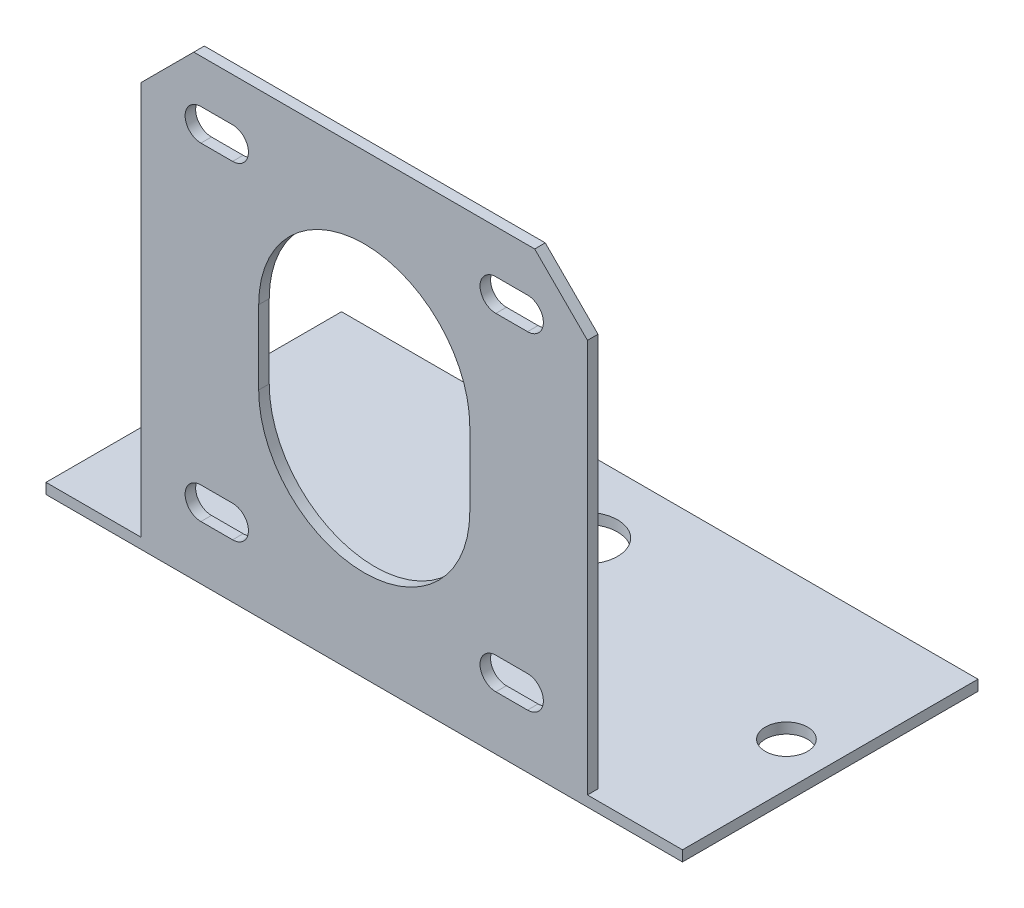
ISO-10303-21;
HEADER;
FILE_DESCRIPTION(('STEP AP214'),'2;1');
FILE_NAME('part.step','',(''),(''),'','','');
FILE_SCHEMA(('AUTOMOTIVE_DESIGN { 1 0 10303 214 1 1 1 1 }'));
ENDSEC;
DATA;
#1=APPLICATION_CONTEXT('core data for automotive mechanical design processes');
#2=APPLICATION_PROTOCOL_DEFINITION('international standard','automotive_design',2000,#1);
#3=PRODUCT_CONTEXT('',#1,'mechanical');
#4=PRODUCT('Part','Part','',(#3));
#5=PRODUCT_RELATED_PRODUCT_CATEGORY('part','',(#4));
#6=PRODUCT_DEFINITION_FORMATION('','',#4);
#7=PRODUCT_DEFINITION_CONTEXT('part definition',#1,'design');
#8=PRODUCT_DEFINITION('design','',#6,#7);
#9=PRODUCT_DEFINITION_SHAPE('','',#8);
#10=(LENGTH_UNIT() NAMED_UNIT(*) SI_UNIT(.MILLI.,.METRE.));
#11=(NAMED_UNIT(*) PLANE_ANGLE_UNIT() SI_UNIT($,.RADIAN.));
#12=(NAMED_UNIT(*) SI_UNIT($,.STERADIAN.) SOLID_ANGLE_UNIT());
#13=UNCERTAINTY_MEASURE_WITH_UNIT(LENGTH_MEASURE(1.E-05),#10,'distance_accuracy_value','');
#14=(GEOMETRIC_REPRESENTATION_CONTEXT(3) GLOBAL_UNCERTAINTY_ASSIGNED_CONTEXT((#13)) GLOBAL_UNIT_ASSIGNED_CONTEXT((#10,
#11,#12)) REPRESENTATION_CONTEXT('',''));
#15=CARTESIAN_POINT('',(0.,0.,0.));
#16=DIRECTION('',(0.,0.,1.));
#17=DIRECTION('',(1.,0.,0.));
#18=AXIS2_PLACEMENT_3D('',#15,#16,#17);
#19=CARTESIAN_POINT('',(21.15,-21.15,1.));
#20=DIRECTION('',(-1.,0.,0.));
#21=DIRECTION('',(0.,0.,1.));
#22=AXIS2_PLACEMENT_3D('',#19,#20,#21);
#23=PLANE('',#22);
#24=DIRECTION('',(0.,0.,1.));
#25=VECTOR('',#24,1.);
#26=CARTESIAN_POINT('',(21.15,-21.15,0.));
#27=LINE('',#26,#25);
#28=CARTESIAN_POINT('',(21.15,-21.15,0.));
#29=VERTEX_POINT('',#28);
#30=CARTESIAN_POINT('',(21.15,-21.15,1.));
#31=VERTEX_POINT('',#30);
#32=EDGE_CURVE('E46',#29,#31,#27,.T.);
#33=ORIENTED_EDGE('',*,*,#32,.F.);
#34=DIRECTION('',(0.,1.,0.));
#35=VECTOR('',#34,1.);
#36=CARTESIAN_POINT('',(21.15,-21.15,0.));
#37=LINE('',#36,#35);
#38=CARTESIAN_POINT('',(21.15,16.15,0.));
#39=VERTEX_POINT('',#38);
#40=EDGE_CURVE('E446',#29,#39,#37,.T.);
#41=ORIENTED_EDGE('',*,*,#40,.T.);
#42=DIRECTION('',(0.,0.,1.));
#43=VECTOR('',#42,1.);
#44=CARTESIAN_POINT('',(21.15,16.15,1.));
#45=LINE('',#44,#43);
#46=CARTESIAN_POINT('',(21.15,16.15,1.));
#47=VERTEX_POINT('',#46);
#48=EDGE_CURVE('E471',#39,#47,#45,.T.);
#49=ORIENTED_EDGE('',*,*,#48,.T.);
#50=DIRECTION('',(0.,1.,0.));
#51=VECTOR('',#50,1.);
#52=CARTESIAN_POINT('',(21.15,-21.15,1.));
#53=LINE('',#52,#51);
#54=EDGE_CURVE('E435',#31,#47,#53,.T.);
#55=ORIENTED_EDGE('',*,*,#54,.F.);
#56=EDGE_LOOP('',(#33,#41,#49,#55));
#57=FACE_BOUND('',#56,.T.);
#58=ADVANCED_FACE('F36',(#57),#23,.F.);
#59=CARTESIAN_POINT('',(0.,0.,1.));
#60=DIRECTION('',(0.,0.,1.));
#61=DIRECTION('',(1.,0.,0.));
#62=AXIS2_PLACEMENT_3D('',#59,#60,#61);
#63=PLANE('',#62);
#64=CARTESIAN_POINT('',(15.4709315688123,15.525299873685,1.));
#65=DIRECTION('',(0.,0.,1.));
#66=DIRECTION('',(-1.,0.,0.));
#67=AXIS2_PLACEMENT_3D('',#64,#65,#66);
#68=CIRCLE('',#67,1.5);
#69=CARTESIAN_POINT('',(15.4709315688123,14.025299873685,1.));
#70=VERTEX_POINT('',#69);
#71=CARTESIAN_POINT('',(15.4709315688123,17.025299873685,1.));
#72=VERTEX_POINT('',#71);
#73=EDGE_CURVE('E292',#70,#72,#68,.T.);
#74=ORIENTED_EDGE('',*,*,#73,.F.);
#75=DIRECTION('',(1.,0.,0.));
#76=VECTOR('',#75,1.);
#77=CARTESIAN_POINT('',(15.4709315688123,14.025299873685,1.));
#78=LINE('',#77,#76);
#79=CARTESIAN_POINT('',(12.4709315688123,14.025299873685,1.));
#80=VERTEX_POINT('',#79);
#81=EDGE_CURVE('E300',#80,#70,#78,.T.);
#82=ORIENTED_EDGE('',*,*,#81,.F.);
#83=CARTESIAN_POINT('',(12.4709315688123,15.525299873685,1.));
#84=DIRECTION('',(0.,0.,1.));
#85=DIRECTION('',(-1.,0.,0.));
#86=AXIS2_PLACEMENT_3D('',#83,#84,#85);
#87=CIRCLE('',#86,1.5);
#88=CARTESIAN_POINT('',(12.4709315688123,17.025299873685,1.));
#89=VERTEX_POINT('',#88);
#90=EDGE_CURVE('E297',#89,#80,#87,.T.);
#91=ORIENTED_EDGE('',*,*,#90,.F.);
#92=DIRECTION('',(-1.,0.,0.));
#93=VECTOR('',#92,1.);
#94=CARTESIAN_POINT('',(15.4709315688123,17.025299873685,1.));
#95=LINE('',#94,#93);
#96=EDGE_CURVE('E294',#72,#89,#95,.T.);
#97=ORIENTED_EDGE('',*,*,#96,.F.);
#98=EDGE_LOOP('',(#74,#82,#91,#97));
#99=FACE_BOUND('',#98,.T.);
#100=CARTESIAN_POINT('',(0.,3.5,1.));
#101=DIRECTION('',(0.,0.,1.));
#102=DIRECTION('',(1.,0.,0.));
#103=AXIS2_PLACEMENT_3D('',#100,#101,#102);
#104=CIRCLE('',#103,10.);
#105=CARTESIAN_POINT('',(10.,3.5,1.));
#106=VERTEX_POINT('',#105);
#107=CARTESIAN_POINT('',(-10.,3.5,1.));
#108=VERTEX_POINT('',#107);
#109=EDGE_CURVE('E348',#106,#108,#104,.T.);
#110=ORIENTED_EDGE('',*,*,#109,.F.);
#111=DIRECTION('',(0.,1.,0.));
#112=VECTOR('',#111,1.);
#113=CARTESIAN_POINT('',(10.,3.5,1.));
#114=LINE('',#113,#112);
#115=CARTESIAN_POINT('',(10.,-3.5,1.));
#116=VERTEX_POINT('',#115);
#117=EDGE_CURVE('E356',#116,#106,#114,.T.);
#118=ORIENTED_EDGE('',*,*,#117,.F.);
#119=CARTESIAN_POINT('',(0.,-3.5,1.));
#120=DIRECTION('',(0.,0.,1.));
#121=DIRECTION('',(1.,0.,0.));
#122=AXIS2_PLACEMENT_3D('',#119,#120,#121);
#123=CIRCLE('',#122,10.);
#124=CARTESIAN_POINT('',(-10.,-3.5,1.));
#125=VERTEX_POINT('',#124);
#126=EDGE_CURVE('E353',#125,#116,#123,.T.);
#127=ORIENTED_EDGE('',*,*,#126,.F.);
#128=DIRECTION('',(0.,-1.,0.));
#129=VECTOR('',#128,1.);
#130=CARTESIAN_POINT('',(-10.,3.5,1.));
#131=LINE('',#130,#129);
#132=EDGE_CURVE('E350',#108,#125,#131,.T.);
#133=ORIENTED_EDGE('',*,*,#132,.F.);
#134=EDGE_LOOP('',(#110,#118,#127,#133));
#135=FACE_BOUND('',#134,.T.);
#136=CARTESIAN_POINT('',(-15.4709315688123,-15.525299873685,1.));
#137=DIRECTION('',(0.,0.,1.));
#138=DIRECTION('',(1.,0.,0.));
#139=AXIS2_PLACEMENT_3D('',#136,#137,#138);
#140=CIRCLE('',#139,1.5);
#141=CARTESIAN_POINT('',(-15.4709315688123,-14.025299873685,1.));
#142=VERTEX_POINT('',#141);
#143=CARTESIAN_POINT('',(-15.4709315688123,-17.025299873685,1.));
#144=VERTEX_POINT('',#143);
#145=EDGE_CURVE('E409',#142,#144,#140,.T.);
#146=ORIENTED_EDGE('',*,*,#145,.F.);
#147=DIRECTION('',(-1.,0.,0.));
#148=VECTOR('',#147,1.);
#149=CARTESIAN_POINT('',(-15.4709315688123,-14.025299873685,1.));
#150=LINE('',#149,#148);
#151=CARTESIAN_POINT('',(-12.4709315688123,-14.025299873685,1.));
#152=VERTEX_POINT('',#151);
#153=EDGE_CURVE('E417',#152,#142,#150,.T.);
#154=ORIENTED_EDGE('',*,*,#153,.F.);
#155=CARTESIAN_POINT('',(-12.4709315688123,-15.525299873685,1.));
#156=DIRECTION('',(0.,0.,1.));
#157=DIRECTION('',(1.,0.,0.));
#158=AXIS2_PLACEMENT_3D('',#155,#156,#157);
#159=CIRCLE('',#158,1.5);
#160=CARTESIAN_POINT('',(-12.4709315688123,-17.025299873685,1.));
#161=VERTEX_POINT('',#160);
#162=EDGE_CURVE('E414',#161,#152,#159,.T.);
#163=ORIENTED_EDGE('',*,*,#162,.F.);
#164=DIRECTION('',(1.,0.,0.));
#165=VECTOR('',#164,1.);
#166=CARTESIAN_POINT('',(-15.4709315688123,-17.025299873685,1.));
#167=LINE('',#166,#165);
#168=EDGE_CURVE('E411',#144,#161,#167,.T.);
#169=ORIENTED_EDGE('',*,*,#168,.F.);
#170=EDGE_LOOP('',(#146,#154,#163,#169));
#171=FACE_BOUND('',#170,.T.);
#172=DIRECTION('',(-1.,0.,0.));
#173=VECTOR('',#172,1.);
#174=CARTESIAN_POINT('',(-21.15,-22.15,1.));
#175=LINE('',#174,#173);
#176=CARTESIAN_POINT('',(30.15,-22.15,1.));
#177=VERTEX_POINT('',#176);
#178=CARTESIAN_POINT('',(-30.15,-22.15,1.));
#179=VERTEX_POINT('',#178);
#180=EDGE_CURVE('E245',#177,#179,#175,.T.);
#181=ORIENTED_EDGE('',*,*,#180,.F.);
#182=DIRECTION('',(0.,-1.,0.));
#183=VECTOR('',#182,1.);
#184=CARTESIAN_POINT('',(30.15,-21.15,1.));
#185=LINE('',#184,#183);
#186=CARTESIAN_POINT('',(30.15,-21.15,1.));
#187=VERTEX_POINT('',#186);
#188=EDGE_CURVE('E268',#187,#177,#185,.T.);
#189=ORIENTED_EDGE('',*,*,#188,.F.);
#190=DIRECTION('',(-1.,0.,0.));
#191=VECTOR('',#190,1.);
#192=CARTESIAN_POINT('',(30.15,-21.15,1.));
#193=LINE('',#192,#191);
#194=EDGE_CURVE('E276',#187,#31,#193,.T.);
#195=ORIENTED_EDGE('',*,*,#194,.T.);
#196=ORIENTED_EDGE('',*,*,#54,.T.);
#197=DIRECTION('',(0.707106781186547,-0.707106781186549,0.));
#198=VECTOR('',#197,1.);
#199=CARTESIAN_POINT('',(18.65,18.65,1.));
#200=LINE('',#199,#198);
#201=CARTESIAN_POINT('',(16.15,21.15,1.));
#202=VERTEX_POINT('',#201);
#203=EDGE_CURVE('E475',#47,#202,#200,.F.);
#204=ORIENTED_EDGE('',*,*,#203,.T.);
#205=DIRECTION('',(-1.,0.,0.));
#206=VECTOR('',#205,1.);
#207=CARTESIAN_POINT('',(21.15,21.15,1.));
#208=LINE('',#207,#206);
#209=CARTESIAN_POINT('',(-16.15,21.15,1.));
#210=VERTEX_POINT('',#209);
#211=EDGE_CURVE('E438',#202,#210,#208,.T.);
#212=ORIENTED_EDGE('',*,*,#211,.T.);
#213=DIRECTION('',(0.707106781186549,0.707106781186546,0.));
#214=VECTOR('',#213,1.);
#215=CARTESIAN_POINT('',(-18.65,18.65,1.));
#216=LINE('',#215,#214);
#217=CARTESIAN_POINT('',(-21.15,16.15,1.));
#218=VERTEX_POINT('',#217);
#219=EDGE_CURVE('E61',#210,#218,#216,.F.);
#220=ORIENTED_EDGE('',*,*,#219,.T.);
#221=DIRECTION('',(0.,-1.,0.));
#222=VECTOR('',#221,1.);
#223=CARTESIAN_POINT('',(-21.15,-21.15,1.));
#224=LINE('',#223,#222);
#225=CARTESIAN_POINT('',(-21.15,-21.15,1.));
#226=VERTEX_POINT('',#225);
#227=EDGE_CURVE('E433',#218,#226,#224,.T.);
#228=ORIENTED_EDGE('',*,*,#227,.T.);
#229=DIRECTION('',(1.,0.,0.));
#230=VECTOR('',#229,1.);
#231=CARTESIAN_POINT('',(-30.15,-21.15,1.));
#232=LINE('',#231,#230);
#233=CARTESIAN_POINT('',(-30.15,-21.15,1.));
#234=VERTEX_POINT('',#233);
#235=EDGE_CURVE('E54',#234,#226,#232,.T.);
#236=ORIENTED_EDGE('',*,*,#235,.F.);
#237=DIRECTION('',(0.,-1.,0.));
#238=VECTOR('',#237,1.);
#239=CARTESIAN_POINT('',(-30.15,-21.15,1.));
#240=LINE('',#239,#238);
#241=EDGE_CURVE('E256',#234,#179,#240,.T.);
#242=ORIENTED_EDGE('',*,*,#241,.T.);
#243=EDGE_LOOP('',(#181,#189,#195,#196,#204,#212,#220,#228,#236,#242));
#244=FACE_BOUND('',#243,.T.);
#245=DIRECTION('',(1.,0.,0.));
#246=VECTOR('',#245,1.);
#247=CARTESIAN_POINT('',(15.4709315688123,-14.025299873685,1.));
#248=LINE('',#247,#246);
#249=CARTESIAN_POINT('',(12.4709315688123,-14.025299873685,1.));
#250=VERTEX_POINT('',#249);
#251=CARTESIAN_POINT('',(15.4709315688123,-14.025299873685,1.));
#252=VERTEX_POINT('',#251);
#253=EDGE_CURVE('E380',#250,#252,#248,.T.);
#254=ORIENTED_EDGE('',*,*,#253,.T.);
#255=CARTESIAN_POINT('',(15.4709315688123,-15.525299873685,1.));
#256=DIRECTION('',(0.,0.,-1.));
#257=DIRECTION('',(-1.,0.,0.));
#258=AXIS2_PLACEMENT_3D('',#255,#256,#257);
#259=CIRCLE('',#258,1.5);
#260=CARTESIAN_POINT('',(15.4709315688123,-17.025299873685,1.));
#261=VERTEX_POINT('',#260);
#262=EDGE_CURVE('E377',#252,#261,#259,.T.);
#263=ORIENTED_EDGE('',*,*,#262,.T.);
#264=DIRECTION('',(-1.,0.,0.));
#265=VECTOR('',#264,1.);
#266=CARTESIAN_POINT('',(15.4709315688123,-17.025299873685,1.));
#267=LINE('',#266,#265);
#268=CARTESIAN_POINT('',(12.4709315688123,-17.025299873685,1.));
#269=VERTEX_POINT('',#268);
#270=EDGE_CURVE('E386',#261,#269,#267,.T.);
#271=ORIENTED_EDGE('',*,*,#270,.T.);
#272=CARTESIAN_POINT('',(12.4709315688123,-15.525299873685,1.));
#273=DIRECTION('',(0.,0.,-1.));
#274=DIRECTION('',(-1.,0.,0.));
#275=AXIS2_PLACEMENT_3D('',#272,#273,#274);
#276=CIRCLE('',#275,1.5);
#277=EDGE_CURVE('E383',#269,#250,#276,.T.);
#278=ORIENTED_EDGE('',*,*,#277,.T.);
#279=EDGE_LOOP('',(#254,#263,#271,#278));
#280=FACE_BOUND('',#279,.T.);
#281=DIRECTION('',(-1.,0.,0.));
#282=VECTOR('',#281,1.);
#283=CARTESIAN_POINT('',(-15.4709315688123,14.025299873685,1.));
#284=LINE('',#283,#282);
#285=CARTESIAN_POINT('',(-12.4709315688123,14.025299873685,1.));
#286=VERTEX_POINT('',#285);
#287=CARTESIAN_POINT('',(-15.4709315688123,14.025299873685,1.));
#288=VERTEX_POINT('',#287);
#289=EDGE_CURVE('E327',#286,#288,#284,.T.);
#290=ORIENTED_EDGE('',*,*,#289,.T.);
#291=CARTESIAN_POINT('',(-15.4709315688123,15.525299873685,1.));
#292=DIRECTION('',(0.,0.,-1.));
#293=DIRECTION('',(1.,0.,0.));
#294=AXIS2_PLACEMENT_3D('',#291,#292,#293);
#295=CIRCLE('',#294,1.5);
#296=CARTESIAN_POINT('',(-15.4709315688123,17.025299873685,1.));
#297=VERTEX_POINT('',#296);
#298=EDGE_CURVE('E324',#288,#297,#295,.T.);
#299=ORIENTED_EDGE('',*,*,#298,.T.);
#300=DIRECTION('',(1.,0.,0.));
#301=VECTOR('',#300,1.);
#302=CARTESIAN_POINT('',(-15.4709315688123,17.025299873685,1.));
#303=LINE('',#302,#301);
#304=CARTESIAN_POINT('',(-12.4709315688123,17.025299873685,1.));
#305=VERTEX_POINT('',#304);
#306=EDGE_CURVE('E333',#297,#305,#303,.T.);
#307=ORIENTED_EDGE('',*,*,#306,.T.);
#308=CARTESIAN_POINT('',(-12.4709315688123,15.525299873685,1.));
#309=DIRECTION('',(0.,0.,-1.));
#310=DIRECTION('',(1.,0.,0.));
#311=AXIS2_PLACEMENT_3D('',#308,#309,#310);
#312=CIRCLE('',#311,1.5);
#313=EDGE_CURVE('E330',#305,#286,#312,.T.);
#314=ORIENTED_EDGE('',*,*,#313,.T.);
#315=EDGE_LOOP('',(#290,#299,#307,#314));
#316=FACE_BOUND('',#315,.T.);
#317=ADVANCED_FACE('F497',(#99,#135,#171,#244,#280,#316),#63,.T.);
#318=CARTESIAN_POINT('',(0.,0.,0.));
#319=DIRECTION('',(0.,0.,1.));
#320=DIRECTION('',(1.,0.,0.));
#321=AXIS2_PLACEMENT_3D('',#318,#319,#320);
#322=PLANE('',#321);
#323=DIRECTION('',(-1.,0.,0.));
#324=VECTOR('',#323,1.);
#325=CARTESIAN_POINT('',(15.4709315688123,14.025299873685,0.));
#326=LINE('',#325,#324);
#327=CARTESIAN_POINT('',(15.4709315688123,14.025299873685,0.));
#328=VERTEX_POINT('',#327);
#329=CARTESIAN_POINT('',(12.4709315688123,14.025299873685,0.));
#330=VERTEX_POINT('',#329);
#331=EDGE_CURVE('E286',#328,#330,#326,.T.);
#332=ORIENTED_EDGE('',*,*,#331,.F.);
#333=CARTESIAN_POINT('',(15.4709315688123,15.525299873685,0.));
#334=DIRECTION('',(0.,0.,1.));
#335=DIRECTION('',(1.,0.,0.));
#336=AXIS2_PLACEMENT_3D('',#333,#334,#335);
#337=CIRCLE('',#336,1.5);
#338=CARTESIAN_POINT('',(15.4709315688123,17.025299873685,0.));
#339=VERTEX_POINT('',#338);
#340=EDGE_CURVE('E289',#339,#328,#337,.F.);
#341=ORIENTED_EDGE('',*,*,#340,.F.);
#342=DIRECTION('',(1.,0.,0.));
#343=VECTOR('',#342,1.);
#344=CARTESIAN_POINT('',(15.4709315688123,17.025299873685,0.));
#345=LINE('',#344,#343);
#346=CARTESIAN_POINT('',(12.4709315688123,17.025299873685,0.));
#347=VERTEX_POINT('',#346);
#348=EDGE_CURVE('E306',#347,#339,#345,.T.);
#349=ORIENTED_EDGE('',*,*,#348,.F.);
#350=CARTESIAN_POINT('',(12.4709315688123,15.525299873685,0.));
#351=DIRECTION('',(0.,0.,1.));
#352=DIRECTION('',(1.,0.,0.));
#353=AXIS2_PLACEMENT_3D('',#350,#351,#352);
#354=CIRCLE('',#353,1.5);
#355=EDGE_CURVE('E284',#330,#347,#354,.F.);
#356=ORIENTED_EDGE('',*,*,#355,.F.);
#357=EDGE_LOOP('',(#332,#341,#349,#356));
#358=FACE_BOUND('',#357,.T.);
#359=CARTESIAN_POINT('',(15.4709315688123,-15.525299873685,0.));
#360=DIRECTION('',(0.,0.,1.));
#361=DIRECTION('',(1.,0.,0.));
#362=AXIS2_PLACEMENT_3D('',#359,#360,#361);
#363=CIRCLE('',#362,1.5);
#364=CARTESIAN_POINT('',(15.4709315688123,-17.025299873685,0.));
#365=VERTEX_POINT('',#364);
#366=CARTESIAN_POINT('',(15.4709315688123,-14.025299873685,0.));
#367=VERTEX_POINT('',#366);
#368=EDGE_CURVE('E374',#365,#367,#363,.T.);
#369=ORIENTED_EDGE('',*,*,#368,.T.);
#370=DIRECTION('',(-1.,0.,0.));
#371=VECTOR('',#370,1.);
#372=CARTESIAN_POINT('',(15.4709315688123,-14.025299873685,0.));
#373=LINE('',#372,#371);
#374=CARTESIAN_POINT('',(12.4709315688123,-14.025299873685,0.));
#375=VERTEX_POINT('',#374);
#376=EDGE_CURVE('E392',#367,#375,#373,.T.);
#377=ORIENTED_EDGE('',*,*,#376,.T.);
#378=CARTESIAN_POINT('',(12.4709315688123,-15.525299873685,0.));
#379=DIRECTION('',(0.,0.,1.));
#380=DIRECTION('',(1.,0.,0.));
#381=AXIS2_PLACEMENT_3D('',#378,#379,#380);
#382=CIRCLE('',#381,1.5);
#383=CARTESIAN_POINT('',(12.4709315688123,-17.025299873685,0.));
#384=VERTEX_POINT('',#383);
#385=EDGE_CURVE('E362',#375,#384,#382,.T.);
#386=ORIENTED_EDGE('',*,*,#385,.T.);
#387=DIRECTION('',(1.,0.,0.));
#388=VECTOR('',#387,1.);
#389=CARTESIAN_POINT('',(15.4709315688123,-17.025299873685,0.));
#390=LINE('',#389,#388);
#391=EDGE_CURVE('E371',#384,#365,#390,.T.);
#392=ORIENTED_EDGE('',*,*,#391,.T.);
#393=EDGE_LOOP('',(#369,#377,#386,#392));
#394=FACE_BOUND('',#393,.T.);
#395=DIRECTION('',(1.,0.,0.));
#396=VECTOR('',#395,1.);
#397=CARTESIAN_POINT('',(-15.4709315688123,-14.025299873685,0.));
#398=LINE('',#397,#396);
#399=CARTESIAN_POINT('',(-15.4709315688123,-14.025299873685,0.));
#400=VERTEX_POINT('',#399);
#401=CARTESIAN_POINT('',(-12.4709315688123,-14.025299873685,0.));
#402=VERTEX_POINT('',#401);
#403=EDGE_CURVE('E403',#400,#402,#398,.T.);
#404=ORIENTED_EDGE('',*,*,#403,.F.);
#405=CARTESIAN_POINT('',(-15.4709315688123,-15.525299873685,0.));
#406=DIRECTION('',(0.,0.,1.));
#407=DIRECTION('',(1.,0.,0.));
#408=AXIS2_PLACEMENT_3D('',#405,#406,#407);
#409=CIRCLE('',#408,1.5);
#410=CARTESIAN_POINT('',(-15.4709315688123,-17.025299873685,0.));
#411=VERTEX_POINT('',#410);
#412=EDGE_CURVE('E406',#411,#400,#409,.F.);
#413=ORIENTED_EDGE('',*,*,#412,.F.);
#414=DIRECTION('',(-1.,0.,0.));
#415=VECTOR('',#414,1.);
#416=CARTESIAN_POINT('',(-15.4709315688123,-17.025299873685,0.));
#417=LINE('',#416,#415);
#418=CARTESIAN_POINT('',(-12.4709315688123,-17.025299873685,0.));
#419=VERTEX_POINT('',#418);
#420=EDGE_CURVE('E423',#419,#411,#417,.T.);
#421=ORIENTED_EDGE('',*,*,#420,.F.);
#422=CARTESIAN_POINT('',(-12.4709315688123,-15.525299873685,0.));
#423=DIRECTION('',(0.,0.,1.));
#424=DIRECTION('',(1.,0.,0.));
#425=AXIS2_PLACEMENT_3D('',#422,#423,#424);
#426=CIRCLE('',#425,1.5);
#427=EDGE_CURVE('E401',#402,#419,#426,.F.);
#428=ORIENTED_EDGE('',*,*,#427,.F.);
#429=EDGE_LOOP('',(#404,#413,#421,#428));
#430=FACE_BOUND('',#429,.T.);
#431=DIRECTION('',(-1.,0.,0.));
#432=VECTOR('',#431,1.);
#433=CARTESIAN_POINT('',(21.15,21.15,0.));
#434=LINE('',#433,#432);
#435=CARTESIAN_POINT('',(16.15,21.15,0.));
#436=VERTEX_POINT('',#435);
#437=CARTESIAN_POINT('',(-16.15,21.15,0.));
#438=VERTEX_POINT('',#437);
#439=EDGE_CURVE('E436',#436,#438,#434,.T.);
#440=ORIENTED_EDGE('',*,*,#439,.F.);
#441=DIRECTION('',(-0.707106781186547,0.707106781186549,0.));
#442=VECTOR('',#441,1.);
#443=CARTESIAN_POINT('',(16.15,21.15,0.));
#444=LINE('',#443,#442);
#445=EDGE_CURVE('E469',#436,#39,#444,.F.);
#446=ORIENTED_EDGE('',*,*,#445,.T.);
#447=ORIENTED_EDGE('',*,*,#40,.F.);
#448=DIRECTION('',(1.,0.,0.));
#449=VECTOR('',#448,1.);
#450=CARTESIAN_POINT('',(21.15,-21.15,0.));
#451=LINE('',#450,#449);
#452=CARTESIAN_POINT('',(-21.15,-21.15,0.));
#453=VERTEX_POINT('',#452);
#454=EDGE_CURVE('E443',#453,#29,#451,.T.);
#455=ORIENTED_EDGE('',*,*,#454,.F.);
#456=DIRECTION('',(0.,-1.,0.));
#457=VECTOR('',#456,1.);
#458=CARTESIAN_POINT('',(-21.15,-21.15,0.));
#459=LINE('',#458,#457);
#460=CARTESIAN_POINT('',(-21.15,16.15,0.));
#461=VERTEX_POINT('',#460);
#462=EDGE_CURVE('E432',#461,#453,#459,.T.);
#463=ORIENTED_EDGE('',*,*,#462,.F.);
#464=DIRECTION('',(-0.707106781186549,-0.707106781186546,0.));
#465=VECTOR('',#464,1.);
#466=CARTESIAN_POINT('',(-21.15,16.15,0.));
#467=LINE('',#466,#465);
#468=EDGE_CURVE('E467',#461,#438,#467,.F.);
#469=ORIENTED_EDGE('',*,*,#468,.T.);
#470=EDGE_LOOP('',(#440,#446,#447,#455,#463,#469));
#471=FACE_BOUND('',#470,.T.);
#472=DIRECTION('',(0.,1.,0.));
#473=VECTOR('',#472,1.);
#474=CARTESIAN_POINT('',(10.,0.,0.));
#475=LINE('',#474,#473);
#476=CARTESIAN_POINT('',(10.,-3.5,0.));
#477=VERTEX_POINT('',#476);
#478=CARTESIAN_POINT('',(10.,3.5,0.));
#479=VERTEX_POINT('',#478);
#480=EDGE_CURVE('E456',#477,#479,#475,.T.);
#481=ORIENTED_EDGE('',*,*,#480,.T.);
#482=CARTESIAN_POINT('',(0.,3.5,0.));
#483=DIRECTION('',(0.,0.,1.));
#484=DIRECTION('',(1.,0.,0.));
#485=AXIS2_PLACEMENT_3D('',#482,#483,#484);
#486=CIRCLE('',#485,10.);
#487=CARTESIAN_POINT('',(-10.,3.5,0.));
#488=VERTEX_POINT('',#487);
#489=EDGE_CURVE('E459',#479,#488,#486,.T.);
#490=ORIENTED_EDGE('',*,*,#489,.T.);
#491=DIRECTION('',(0.,-1.,0.));
#492=VECTOR('',#491,1.);
#493=CARTESIAN_POINT('',(-10.,0.,0.));
#494=LINE('',#493,#492);
#495=CARTESIAN_POINT('',(-10.,-3.5,0.));
#496=VERTEX_POINT('',#495);
#497=EDGE_CURVE('E440',#488,#496,#494,.T.);
#498=ORIENTED_EDGE('',*,*,#497,.T.);
#499=CARTESIAN_POINT('',(0.,-3.5,0.));
#500=DIRECTION('',(0.,0.,1.));
#501=DIRECTION('',(1.,0.,0.));
#502=AXIS2_PLACEMENT_3D('',#499,#500,#501);
#503=CIRCLE('',#502,10.);
#504=EDGE_CURVE('E453',#496,#477,#503,.T.);
#505=ORIENTED_EDGE('',*,*,#504,.T.);
#506=EDGE_LOOP('',(#481,#490,#498,#505));
#507=FACE_BOUND('',#506,.T.);
#508=CARTESIAN_POINT('',(-15.4709315688123,15.525299873685,0.));
#509=DIRECTION('',(0.,0.,1.));
#510=DIRECTION('',(1.,0.,0.));
#511=AXIS2_PLACEMENT_3D('',#508,#509,#510);
#512=CIRCLE('',#511,1.5);
#513=CARTESIAN_POINT('',(-15.4709315688123,17.025299873685,0.));
#514=VERTEX_POINT('',#513);
#515=CARTESIAN_POINT('',(-15.4709315688123,14.025299873685,0.));
#516=VERTEX_POINT('',#515);
#517=EDGE_CURVE('E321',#514,#516,#512,.T.);
#518=ORIENTED_EDGE('',*,*,#517,.T.);
#519=DIRECTION('',(1.,0.,0.));
#520=VECTOR('',#519,1.);
#521=CARTESIAN_POINT('',(-15.4709315688123,14.025299873685,0.));
#522=LINE('',#521,#520);
#523=CARTESIAN_POINT('',(-12.4709315688123,14.025299873685,0.));
#524=VERTEX_POINT('',#523);
#525=EDGE_CURVE('E339',#516,#524,#522,.T.);
#526=ORIENTED_EDGE('',*,*,#525,.T.);
#527=CARTESIAN_POINT('',(-12.4709315688123,15.525299873685,0.));
#528=DIRECTION('',(0.,0.,1.));
#529=DIRECTION('',(1.,0.,0.));
#530=AXIS2_PLACEMENT_3D('',#527,#528,#529);
#531=CIRCLE('',#530,1.5);
#532=CARTESIAN_POINT('',(-12.4709315688123,17.025299873685,0.));
#533=VERTEX_POINT('',#532);
#534=EDGE_CURVE('E315',#524,#533,#531,.T.);
#535=ORIENTED_EDGE('',*,*,#534,.T.);
#536=DIRECTION('',(-1.,0.,0.));
#537=VECTOR('',#536,1.);
#538=CARTESIAN_POINT('',(-15.4709315688123,17.025299873685,0.));
#539=LINE('',#538,#537);
#540=EDGE_CURVE('E318',#533,#514,#539,.T.);
#541=ORIENTED_EDGE('',*,*,#540,.T.);
#542=EDGE_LOOP('',(#518,#526,#535,#541));
#543=FACE_BOUND('',#542,.T.);
#544=ADVANCED_FACE('F507',(#358,#394,#430,#471,#507,#543),#322,.F.);
#545=CARTESIAN_POINT('',(-21.15,-21.15,1.));
#546=DIRECTION('',(1.,0.,0.));
#547=DIRECTION('',(0.,0.,-1.));
#548=AXIS2_PLACEMENT_3D('',#545,#546,#547);
#549=PLANE('',#548);
#550=ORIENTED_EDGE('',*,*,#462,.T.);
#551=DIRECTION('',(0.,0.,1.));
#552=VECTOR('',#551,1.);
#553=CARTESIAN_POINT('',(-21.15,-21.15,0.));
#554=LINE('',#553,#552);
#555=EDGE_CURVE('E11',#453,#226,#554,.T.);
#556=ORIENTED_EDGE('',*,*,#555,.T.);
#557=ORIENTED_EDGE('',*,*,#227,.F.);
#558=DIRECTION('',(0.,0.,-1.));
#559=VECTOR('',#558,1.);
#560=CARTESIAN_POINT('',(-21.15,16.15,1.));
#561=LINE('',#560,#559);
#562=EDGE_CURVE('E279',#218,#461,#561,.T.);
#563=ORIENTED_EDGE('',*,*,#562,.T.);
#564=EDGE_LOOP('',(#550,#556,#557,#563));
#565=FACE_BOUND('',#564,.T.);
#566=ADVANCED_FACE('F501',(#565),#549,.F.);
#567=CARTESIAN_POINT('',(21.15,21.15,1.));
#568=DIRECTION('',(0.,-1.,0.));
#569=DIRECTION('',(1.,0.,0.));
#570=AXIS2_PLACEMENT_3D('',#567,#568,#569);
#571=PLANE('',#570);
#572=ORIENTED_EDGE('',*,*,#211,.F.);
#573=DIRECTION('',(0.,0.,-1.));
#574=VECTOR('',#573,1.);
#575=CARTESIAN_POINT('',(16.15,21.15,1.));
#576=LINE('',#575,#574);
#577=EDGE_CURVE('E464',#202,#436,#576,.T.);
#578=ORIENTED_EDGE('',*,*,#577,.T.);
#579=ORIENTED_EDGE('',*,*,#439,.T.);
#580=DIRECTION('',(0.,0.,1.));
#581=VECTOR('',#580,1.);
#582=CARTESIAN_POINT('',(-16.15,21.15,1.));
#583=LINE('',#582,#581);
#584=EDGE_CURVE('E462',#438,#210,#583,.T.);
#585=ORIENTED_EDGE('',*,*,#584,.T.);
#586=EDGE_LOOP('',(#572,#578,#579,#585));
#587=FACE_BOUND('',#586,.T.);
#588=ADVANCED_FACE('F512',(#587),#571,.F.);
#589=CARTESIAN_POINT('',(-15.4709315688123,-15.525299873685,-0.000999999999999916));
#590=DIRECTION('',(0.,0.,1.));
#591=DIRECTION('',(1.,0.,0.));
#592=AXIS2_PLACEMENT_3D('',#589,#590,#591);
#593=CYLINDRICAL_SURFACE('',#592,1.5);
#594=ORIENTED_EDGE('',*,*,#412,.T.);
#595=DIRECTION('',(0.,0.,1.));
#596=VECTOR('',#595,1.);
#597=CARTESIAN_POINT('',(-15.4709315688123,-14.025299873685,-0.000999999999999916));
#598=LINE('',#597,#596);
#599=EDGE_CURVE('E421',#400,#142,#598,.T.);
#600=ORIENTED_EDGE('',*,*,#599,.T.);
#601=ORIENTED_EDGE('',*,*,#145,.T.);
#602=DIRECTION('',(0.,0.,1.));
#603=VECTOR('',#602,1.);
#604=CARTESIAN_POINT('',(-15.4709315688123,-17.025299873685,-0.000999999999999916));
#605=LINE('',#604,#603);
#606=EDGE_CURVE('E420',#411,#144,#605,.T.);
#607=ORIENTED_EDGE('',*,*,#606,.F.);
#608=EDGE_LOOP('',(#594,#600,#601,#607));
#609=FACE_BOUND('',#608,.T.);
#610=ADVANCED_FACE('F619',(#609),#593,.F.);
#611=CARTESIAN_POINT('',(-15.4709315688123,-14.025299873685,-0.000999999999999916));
#612=DIRECTION('',(0.,1.,0.));
#613=DIRECTION('',(0.,0.,1.));
#614=AXIS2_PLACEMENT_3D('',#611,#612,#613);
#615=PLANE('',#614);
#616=ORIENTED_EDGE('',*,*,#403,.T.);
#617=DIRECTION('',(0.,0.,1.));
#618=VECTOR('',#617,1.);
#619=CARTESIAN_POINT('',(-12.4709315688123,-14.025299873685,-0.000999999999999916));
#620=LINE('',#619,#618);
#621=EDGE_CURVE('E424',#402,#152,#620,.T.);
#622=ORIENTED_EDGE('',*,*,#621,.T.);
#623=ORIENTED_EDGE('',*,*,#153,.T.);
#624=ORIENTED_EDGE('',*,*,#599,.F.);
#625=EDGE_LOOP('',(#616,#622,#623,#624));
#626=FACE_BOUND('',#625,.T.);
#627=ADVANCED_FACE('F615',(#626),#615,.F.);
#628=CARTESIAN_POINT('',(-12.4709315688123,-15.525299873685,-0.000999999999999916));
#629=DIRECTION('',(0.,0.,1.));
#630=DIRECTION('',(1.,0.,0.));
#631=AXIS2_PLACEMENT_3D('',#628,#629,#630);
#632=CYLINDRICAL_SURFACE('',#631,1.5);
#633=ORIENTED_EDGE('',*,*,#427,.T.);
#634=DIRECTION('',(0.,0.,1.));
#635=VECTOR('',#634,1.);
#636=CARTESIAN_POINT('',(-12.4709315688123,-17.025299873685,-0.000999999999999916));
#637=LINE('',#636,#635);
#638=EDGE_CURVE('E426',#419,#161,#637,.T.);
#639=ORIENTED_EDGE('',*,*,#638,.T.);
#640=ORIENTED_EDGE('',*,*,#162,.T.);
#641=ORIENTED_EDGE('',*,*,#621,.F.);
#642=EDGE_LOOP('',(#633,#639,#640,#641));
#643=FACE_BOUND('',#642,.T.);
#644=ADVANCED_FACE('F618',(#643),#632,.F.);
#645=CARTESIAN_POINT('',(-15.4709315688123,-17.025299873685,-0.000999999999999916));
#646=DIRECTION('',(0.,-1.,0.));
#647=DIRECTION('',(0.,0.,-1.));
#648=AXIS2_PLACEMENT_3D('',#645,#646,#647);
#649=PLANE('',#648);
#650=ORIENTED_EDGE('',*,*,#420,.T.);
#651=ORIENTED_EDGE('',*,*,#606,.T.);
#652=ORIENTED_EDGE('',*,*,#168,.T.);
#653=ORIENTED_EDGE('',*,*,#638,.F.);
#654=EDGE_LOOP('',(#650,#651,#652,#653));
#655=FACE_BOUND('',#654,.T.);
#656=ADVANCED_FACE('F613',(#655),#649,.F.);
#657=CARTESIAN_POINT('',(15.4709315688123,-15.525299873685,-0.000999999999999916));
#658=DIRECTION('',(0.,0.,1.));
#659=DIRECTION('',(1.,0.,0.));
#660=AXIS2_PLACEMENT_3D('',#657,#658,#659);
#661=CYLINDRICAL_SURFACE('',#660,1.5);
#662=DIRECTION('',(0.,0.,1.));
#663=VECTOR('',#662,1.);
#664=CARTESIAN_POINT('',(15.4709315688123,-17.025299873685,-0.000999999999999916));
#665=LINE('',#664,#663);
#666=EDGE_CURVE('E390',#365,#261,#665,.T.);
#667=ORIENTED_EDGE('',*,*,#666,.T.);
#668=ORIENTED_EDGE('',*,*,#262,.F.);
#669=DIRECTION('',(0.,0.,1.));
#670=VECTOR('',#669,1.);
#671=CARTESIAN_POINT('',(15.4709315688123,-14.025299873685,-0.000999999999999916));
#672=LINE('',#671,#670);
#673=EDGE_CURVE('E389',#367,#252,#672,.T.);
#674=ORIENTED_EDGE('',*,*,#673,.F.);
#675=ORIENTED_EDGE('',*,*,#368,.F.);
#676=EDGE_LOOP('',(#667,#668,#674,#675));
#677=FACE_BOUND('',#676,.T.);
#678=ADVANCED_FACE('F603',(#677),#661,.F.);
#679=CARTESIAN_POINT('',(15.4709315688123,-17.025299873685,-0.000999999999999916));
#680=DIRECTION('',(0.,1.,0.));
#681=DIRECTION('',(0.,0.,1.));
#682=AXIS2_PLACEMENT_3D('',#679,#680,#681);
#683=PLANE('',#682);
#684=DIRECTION('',(0.,0.,1.));
#685=VECTOR('',#684,1.);
#686=CARTESIAN_POINT('',(12.4709315688123,-17.025299873685,-0.000999999999999916));
#687=LINE('',#686,#685);
#688=EDGE_CURVE('E393',#384,#269,#687,.T.);
#689=ORIENTED_EDGE('',*,*,#688,.T.);
#690=ORIENTED_EDGE('',*,*,#270,.F.);
#691=ORIENTED_EDGE('',*,*,#666,.F.);
#692=ORIENTED_EDGE('',*,*,#391,.F.);
#693=EDGE_LOOP('',(#689,#690,#691,#692));
#694=FACE_BOUND('',#693,.T.);
#695=ADVANCED_FACE('F599',(#694),#683,.T.);
#696=CARTESIAN_POINT('',(12.4709315688123,-15.525299873685,-0.000999999999999916));
#697=DIRECTION('',(0.,0.,1.));
#698=DIRECTION('',(1.,0.,0.));
#699=AXIS2_PLACEMENT_3D('',#696,#697,#698);
#700=CYLINDRICAL_SURFACE('',#699,1.5);
#701=DIRECTION('',(0.,0.,1.));
#702=VECTOR('',#701,1.);
#703=CARTESIAN_POINT('',(12.4709315688123,-14.025299873685,-0.000999999999999916));
#704=LINE('',#703,#702);
#705=EDGE_CURVE('E395',#375,#250,#704,.T.);
#706=ORIENTED_EDGE('',*,*,#705,.T.);
#707=ORIENTED_EDGE('',*,*,#277,.F.);
#708=ORIENTED_EDGE('',*,*,#688,.F.);
#709=ORIENTED_EDGE('',*,*,#385,.F.);
#710=EDGE_LOOP('',(#706,#707,#708,#709));
#711=FACE_BOUND('',#710,.T.);
#712=ADVANCED_FACE('F602',(#711),#700,.F.);
#713=CARTESIAN_POINT('',(15.4709315688123,-14.025299873685,-0.000999999999999916));
#714=DIRECTION('',(0.,-1.,0.));
#715=DIRECTION('',(0.,0.,-1.));
#716=AXIS2_PLACEMENT_3D('',#713,#714,#715);
#717=PLANE('',#716);
#718=ORIENTED_EDGE('',*,*,#673,.T.);
#719=ORIENTED_EDGE('',*,*,#253,.F.);
#720=ORIENTED_EDGE('',*,*,#705,.F.);
#721=ORIENTED_EDGE('',*,*,#376,.F.);
#722=EDGE_LOOP('',(#718,#719,#720,#721));
#723=FACE_BOUND('',#722,.T.);
#724=ADVANCED_FACE('F597',(#723),#717,.T.);
#725=CARTESIAN_POINT('',(0.,3.5,-9.));
#726=DIRECTION('',(0.,0.,1.));
#727=DIRECTION('',(1.,0.,0.));
#728=AXIS2_PLACEMENT_3D('',#725,#726,#727);
#729=CYLINDRICAL_SURFACE('',#728,10.);
#730=DIRECTION('',(0.,0.,1.));
#731=VECTOR('',#730,1.);
#732=CARTESIAN_POINT('',(10.,3.5,-9.));
#733=LINE('',#732,#731);
#734=EDGE_CURVE('E360',#479,#106,#733,.T.);
#735=ORIENTED_EDGE('',*,*,#734,.T.);
#736=ORIENTED_EDGE('',*,*,#109,.T.);
#737=DIRECTION('',(0.,0.,1.));
#738=VECTOR('',#737,1.);
#739=CARTESIAN_POINT('',(-10.,3.5,-9.));
#740=LINE('',#739,#738);
#741=EDGE_CURVE('E359',#488,#108,#740,.T.);
#742=ORIENTED_EDGE('',*,*,#741,.F.);
#743=ORIENTED_EDGE('',*,*,#489,.F.);
#744=EDGE_LOOP('',(#735,#736,#742,#743));
#745=FACE_BOUND('',#744,.T.);
#746=ADVANCED_FACE('F587',(#745),#729,.F.);
#747=CARTESIAN_POINT('',(10.,3.5,-9.));
#748=DIRECTION('',(1.,0.,0.));
#749=DIRECTION('',(0.,1.,0.));
#750=AXIS2_PLACEMENT_3D('',#747,#748,#749);
#751=PLANE('',#750);
#752=DIRECTION('',(0.,0.,1.));
#753=VECTOR('',#752,1.);
#754=CARTESIAN_POINT('',(10.,-3.5,-9.));
#755=LINE('',#754,#753);
#756=EDGE_CURVE('E363',#477,#116,#755,.T.);
#757=ORIENTED_EDGE('',*,*,#756,.T.);
#758=ORIENTED_EDGE('',*,*,#117,.T.);
#759=ORIENTED_EDGE('',*,*,#734,.F.);
#760=ORIENTED_EDGE('',*,*,#480,.F.);
#761=EDGE_LOOP('',(#757,#758,#759,#760));
#762=FACE_BOUND('',#761,.T.);
#763=ADVANCED_FACE('F583',(#762),#751,.F.);
#764=CARTESIAN_POINT('',(0.,-3.5,-9.));
#765=DIRECTION('',(0.,0.,1.));
#766=DIRECTION('',(1.,0.,0.));
#767=AXIS2_PLACEMENT_3D('',#764,#765,#766);
#768=CYLINDRICAL_SURFACE('',#767,10.);
#769=DIRECTION('',(0.,0.,1.));
#770=VECTOR('',#769,1.);
#771=CARTESIAN_POINT('',(-10.,-3.5,-9.));
#772=LINE('',#771,#770);
#773=EDGE_CURVE('E365',#496,#125,#772,.T.);
#774=ORIENTED_EDGE('',*,*,#773,.T.);
#775=ORIENTED_EDGE('',*,*,#126,.T.);
#776=ORIENTED_EDGE('',*,*,#756,.F.);
#777=ORIENTED_EDGE('',*,*,#504,.F.);
#778=EDGE_LOOP('',(#774,#775,#776,#777));
#779=FACE_BOUND('',#778,.T.);
#780=ADVANCED_FACE('F586',(#779),#768,.F.);
#781=CARTESIAN_POINT('',(-10.,3.5,-9.));
#782=DIRECTION('',(-1.,0.,0.));
#783=DIRECTION('',(0.,-1.,0.));
#784=AXIS2_PLACEMENT_3D('',#781,#782,#783);
#785=PLANE('',#784);
#786=ORIENTED_EDGE('',*,*,#741,.T.);
#787=ORIENTED_EDGE('',*,*,#132,.T.);
#788=ORIENTED_EDGE('',*,*,#773,.F.);
#789=ORIENTED_EDGE('',*,*,#497,.F.);
#790=EDGE_LOOP('',(#786,#787,#788,#789));
#791=FACE_BOUND('',#790,.T.);
#792=ADVANCED_FACE('F581',(#791),#785,.F.);
#793=CARTESIAN_POINT('',(-15.4709315688123,15.525299873685,-0.000999999999999916));
#794=DIRECTION('',(0.,0.,1.));
#795=DIRECTION('',(1.,0.,0.));
#796=AXIS2_PLACEMENT_3D('',#793,#794,#795);
#797=CYLINDRICAL_SURFACE('',#796,1.5);
#798=DIRECTION('',(0.,0.,1.));
#799=VECTOR('',#798,1.);
#800=CARTESIAN_POINT('',(-15.4709315688123,17.025299873685,-0.000999999999999916));
#801=LINE('',#800,#799);
#802=EDGE_CURVE('E337',#514,#297,#801,.T.);
#803=ORIENTED_EDGE('',*,*,#802,.T.);
#804=ORIENTED_EDGE('',*,*,#298,.F.);
#805=DIRECTION('',(0.,0.,1.));
#806=VECTOR('',#805,1.);
#807=CARTESIAN_POINT('',(-15.4709315688123,14.025299873685,-0.000999999999999916));
#808=LINE('',#807,#806);
#809=EDGE_CURVE('E336',#516,#288,#808,.T.);
#810=ORIENTED_EDGE('',*,*,#809,.F.);
#811=ORIENTED_EDGE('',*,*,#517,.F.);
#812=EDGE_LOOP('',(#803,#804,#810,#811));
#813=FACE_BOUND('',#812,.T.);
#814=ADVANCED_FACE('F571',(#813),#797,.F.);
#815=CARTESIAN_POINT('',(-15.4709315688123,17.025299873685,-0.000999999999999916));
#816=DIRECTION('',(0.,-1.,0.));
#817=DIRECTION('',(0.,0.,-1.));
#818=AXIS2_PLACEMENT_3D('',#815,#816,#817);
#819=PLANE('',#818);
#820=DIRECTION('',(0.,0.,1.));
#821=VECTOR('',#820,1.);
#822=CARTESIAN_POINT('',(-12.4709315688123,17.025299873685,-0.000999999999999916));
#823=LINE('',#822,#821);
#824=EDGE_CURVE('E340',#533,#305,#823,.T.);
#825=ORIENTED_EDGE('',*,*,#824,.T.);
#826=ORIENTED_EDGE('',*,*,#306,.F.);
#827=ORIENTED_EDGE('',*,*,#802,.F.);
#828=ORIENTED_EDGE('',*,*,#540,.F.);
#829=EDGE_LOOP('',(#825,#826,#827,#828));
#830=FACE_BOUND('',#829,.T.);
#831=ADVANCED_FACE('F567',(#830),#819,.T.);
#832=CARTESIAN_POINT('',(-12.4709315688123,15.525299873685,-0.000999999999999916));
#833=DIRECTION('',(0.,0.,1.));
#834=DIRECTION('',(1.,0.,0.));
#835=AXIS2_PLACEMENT_3D('',#832,#833,#834);
#836=CYLINDRICAL_SURFACE('',#835,1.5);
#837=DIRECTION('',(0.,0.,1.));
#838=VECTOR('',#837,1.);
#839=CARTESIAN_POINT('',(-12.4709315688123,14.025299873685,-0.000999999999999916));
#840=LINE('',#839,#838);
#841=EDGE_CURVE('E342',#524,#286,#840,.T.);
#842=ORIENTED_EDGE('',*,*,#841,.T.);
#843=ORIENTED_EDGE('',*,*,#313,.F.);
#844=ORIENTED_EDGE('',*,*,#824,.F.);
#845=ORIENTED_EDGE('',*,*,#534,.F.);
#846=EDGE_LOOP('',(#842,#843,#844,#845));
#847=FACE_BOUND('',#846,.T.);
#848=ADVANCED_FACE('F570',(#847),#836,.F.);
#849=CARTESIAN_POINT('',(-15.4709315688123,14.025299873685,-0.000999999999999916));
#850=DIRECTION('',(0.,1.,0.));
#851=DIRECTION('',(0.,0.,1.));
#852=AXIS2_PLACEMENT_3D('',#849,#850,#851);
#853=PLANE('',#852);
#854=ORIENTED_EDGE('',*,*,#809,.T.);
#855=ORIENTED_EDGE('',*,*,#289,.F.);
#856=ORIENTED_EDGE('',*,*,#841,.F.);
#857=ORIENTED_EDGE('',*,*,#525,.F.);
#858=EDGE_LOOP('',(#854,#855,#856,#857));
#859=FACE_BOUND('',#858,.T.);
#860=ADVANCED_FACE('F565',(#859),#853,.T.);
#861=CARTESIAN_POINT('',(15.4709315688123,15.525299873685,-0.000999999999999916));
#862=DIRECTION('',(0.,0.,1.));
#863=DIRECTION('',(1.,0.,0.));
#864=AXIS2_PLACEMENT_3D('',#861,#862,#863);
#865=CYLINDRICAL_SURFACE('',#864,1.5);
#866=ORIENTED_EDGE('',*,*,#340,.T.);
#867=DIRECTION('',(0.,0.,1.));
#868=VECTOR('',#867,1.);
#869=CARTESIAN_POINT('',(15.4709315688123,14.025299873685,-0.000999999999999916));
#870=LINE('',#869,#868);
#871=EDGE_CURVE('E304',#328,#70,#870,.T.);
#872=ORIENTED_EDGE('',*,*,#871,.T.);
#873=ORIENTED_EDGE('',*,*,#73,.T.);
#874=DIRECTION('',(0.,0.,1.));
#875=VECTOR('',#874,1.);
#876=CARTESIAN_POINT('',(15.4709315688123,17.025299873685,-0.000999999999999916));
#877=LINE('',#876,#875);
#878=EDGE_CURVE('E303',#339,#72,#877,.T.);
#879=ORIENTED_EDGE('',*,*,#878,.F.);
#880=EDGE_LOOP('',(#866,#872,#873,#879));
#881=FACE_BOUND('',#880,.T.);
#882=ADVANCED_FACE('F562',(#881),#865,.F.);
#883=CARTESIAN_POINT('',(15.4709315688123,14.025299873685,-0.000999999999999916));
#884=DIRECTION('',(0.,-1.,0.));
#885=DIRECTION('',(0.,0.,-1.));
#886=AXIS2_PLACEMENT_3D('',#883,#884,#885);
#887=PLANE('',#886);
#888=ORIENTED_EDGE('',*,*,#331,.T.);
#889=DIRECTION('',(0.,0.,1.));
#890=VECTOR('',#889,1.);
#891=CARTESIAN_POINT('',(12.4709315688123,14.025299873685,-0.000999999999999916));
#892=LINE('',#891,#890);
#893=EDGE_CURVE('E307',#330,#80,#892,.T.);
#894=ORIENTED_EDGE('',*,*,#893,.T.);
#895=ORIENTED_EDGE('',*,*,#81,.T.);
#896=ORIENTED_EDGE('',*,*,#871,.F.);
#897=EDGE_LOOP('',(#888,#894,#895,#896));
#898=FACE_BOUND('',#897,.T.);
#899=ADVANCED_FACE('F557',(#898),#887,.F.);
#900=CARTESIAN_POINT('',(12.4709315688123,15.525299873685,-0.000999999999999916));
#901=DIRECTION('',(0.,0.,1.));
#902=DIRECTION('',(1.,0.,0.));
#903=AXIS2_PLACEMENT_3D('',#900,#901,#902);
#904=CYLINDRICAL_SURFACE('',#903,1.5);
#905=ORIENTED_EDGE('',*,*,#355,.T.);
#906=DIRECTION('',(0.,0.,1.));
#907=VECTOR('',#906,1.);
#908=CARTESIAN_POINT('',(12.4709315688123,17.025299873685,-0.000999999999999916));
#909=LINE('',#908,#907);
#910=EDGE_CURVE('E309',#347,#89,#909,.T.);
#911=ORIENTED_EDGE('',*,*,#910,.T.);
#912=ORIENTED_EDGE('',*,*,#90,.T.);
#913=ORIENTED_EDGE('',*,*,#893,.F.);
#914=EDGE_LOOP('',(#905,#911,#912,#913));
#915=FACE_BOUND('',#914,.T.);
#916=ADVANCED_FACE('F551',(#915),#904,.F.);
#917=CARTESIAN_POINT('',(15.4709315688123,17.025299873685,-0.000999999999999916));
#918=DIRECTION('',(0.,1.,0.));
#919=DIRECTION('',(0.,0.,1.));
#920=AXIS2_PLACEMENT_3D('',#917,#918,#919);
#921=PLANE('',#920);
#922=ORIENTED_EDGE('',*,*,#348,.T.);
#923=ORIENTED_EDGE('',*,*,#878,.T.);
#924=ORIENTED_EDGE('',*,*,#96,.T.);
#925=ORIENTED_EDGE('',*,*,#910,.F.);
#926=EDGE_LOOP('',(#922,#923,#924,#925));
#927=FACE_BOUND('',#926,.T.);
#928=ADVANCED_FACE('F546',(#927),#921,.F.);
#929=CARTESIAN_POINT('',(16.15,21.15,1.));
#930=DIRECTION('',(-0.707106781186549,-0.707106781186547,0.));
#931=DIRECTION('',(0.,0.,-1.));
#932=AXIS2_PLACEMENT_3D('',#929,#930,#931);
#933=PLANE('',#932);
#934=ORIENTED_EDGE('',*,*,#203,.F.);
#935=ORIENTED_EDGE('',*,*,#48,.F.);
#936=ORIENTED_EDGE('',*,*,#445,.F.);
#937=ORIENTED_EDGE('',*,*,#577,.F.);
#938=EDGE_LOOP('',(#934,#935,#936,#937));
#939=FACE_BOUND('',#938,.T.);
#940=ADVANCED_FACE('F516',(#939),#933,.F.);
#941=CARTESIAN_POINT('',(-21.15,16.15,1.));
#942=DIRECTION('',(0.707106781186546,-0.707106781186549,0.));
#943=DIRECTION('',(0.,0.,-1.));
#944=AXIS2_PLACEMENT_3D('',#941,#942,#943);
#945=PLANE('',#944);
#946=ORIENTED_EDGE('',*,*,#219,.F.);
#947=ORIENTED_EDGE('',*,*,#584,.F.);
#948=ORIENTED_EDGE('',*,*,#468,.F.);
#949=ORIENTED_EDGE('',*,*,#562,.F.);
#950=EDGE_LOOP('',(#946,#947,#948,#949));
#951=FACE_BOUND('',#950,.T.);
#952=ADVANCED_FACE('F39',(#951),#945,.F.);
#953=CARTESIAN_POINT('',(21.15,-21.15,1.));
#954=DIRECTION('',(0.,1.,0.));
#955=DIRECTION('',(-1.,0.,0.));
#956=AXIS2_PLACEMENT_3D('',#953,#954,#955);
#957=PLANE('',#956);
#958=CARTESIAN_POINT('',(0.,-21.15,-20.));
#959=DIRECTION('',(0.,1.,0.));
#960=DIRECTION('',(-1.,0.,0.));
#961=AXIS2_PLACEMENT_3D('',#958,#959,#960);
#962=CIRCLE('',#961,3.);
#963=CARTESIAN_POINT('',(-2.99999999999999,-21.15,-20.));
#964=VERTEX_POINT('',#963);
#965=EDGE_CURVE('E691',#964,#964,#962,.T.);
#966=ORIENTED_EDGE('',*,*,#965,.F.);
#967=EDGE_LOOP('',(#966));
#968=FACE_BOUND('',#967,.T.);
#969=CARTESIAN_POINT('',(26.,-21.15,-13.));
#970=DIRECTION('',(0.,1.,0.));
#971=DIRECTION('',(-1.,0.,0.));
#972=AXIS2_PLACEMENT_3D('',#969,#970,#971);
#973=CIRCLE('',#972,2.);
#974=CARTESIAN_POINT('',(24.,-21.15,-13.));
#975=VERTEX_POINT('',#974);
#976=EDGE_CURVE('E481',#975,#975,#973,.T.);
#977=ORIENTED_EDGE('',*,*,#976,.F.);
#978=EDGE_LOOP('',(#977));
#979=FACE_BOUND('',#978,.T.);
#980=CARTESIAN_POINT('',(-26.,-21.15,-13.));
#981=DIRECTION('',(0.,1.,0.));
#982=DIRECTION('',(1.,0.,0.));
#983=AXIS2_PLACEMENT_3D('',#980,#981,#982);
#984=CIRCLE('',#983,2.);
#985=CARTESIAN_POINT('',(-24.,-21.15,-13.));
#986=VERTEX_POINT('',#985);
#987=EDGE_CURVE('E697',#986,#986,#984,.T.);
#988=ORIENTED_EDGE('',*,*,#987,.F.);
#989=EDGE_LOOP('',(#988));
#990=FACE_BOUND('',#989,.T.);
#991=DIRECTION('',(1.,0.,0.));
#992=VECTOR('',#991,1.);
#993=CARTESIAN_POINT('',(21.15,-21.15,-27.));
#994=LINE('',#993,#992);
#995=CARTESIAN_POINT('',(-30.15,-21.15,-27.));
#996=VERTEX_POINT('',#995);
#997=CARTESIAN_POINT('',(30.15,-21.15,-27.));
#998=VERTEX_POINT('',#997);
#999=EDGE_CURVE('E235',#996,#998,#994,.T.);
#1000=ORIENTED_EDGE('',*,*,#999,.F.);
#1001=DIRECTION('',(0.,0.,1.));
#1002=VECTOR('',#1001,1.);
#1003=CARTESIAN_POINT('',(-30.15,-21.15,0.));
#1004=LINE('',#1003,#1002);
#1005=EDGE_CURVE('E238',#996,#234,#1004,.T.);
#1006=ORIENTED_EDGE('',*,*,#1005,.T.);
#1007=ORIENTED_EDGE('',*,*,#235,.T.);
#1008=ORIENTED_EDGE('',*,*,#555,.F.);
#1009=ORIENTED_EDGE('',*,*,#454,.T.);
#1010=ORIENTED_EDGE('',*,*,#32,.T.);
#1011=ORIENTED_EDGE('',*,*,#194,.F.);
#1012=DIRECTION('',(0.,0.,1.));
#1013=VECTOR('',#1012,1.);
#1014=CARTESIAN_POINT('',(30.15,-21.15,0.));
#1015=LINE('',#1014,#1013);
#1016=EDGE_CURVE('E240',#998,#187,#1015,.T.);
#1017=ORIENTED_EDGE('',*,*,#1016,.F.);
#1018=EDGE_LOOP('',(#1000,#1006,#1007,#1008,#1009,#1010,#1011,#1017));
#1019=FACE_BOUND('',#1018,.T.);
#1020=ADVANCED_FACE('F237',(#968,#979,#990,#1019),#957,.T.);
#1021=CARTESIAN_POINT('',(-21.15,-22.15,1.));
#1022=DIRECTION('',(0.,-1.,0.));
#1023=DIRECTION('',(1.,0.,0.));
#1024=AXIS2_PLACEMENT_3D('',#1021,#1022,#1023);
#1025=PLANE('',#1024);
#1026=CARTESIAN_POINT('',(0.,-22.15,-20.));
#1027=DIRECTION('',(0.,-1.,0.));
#1028=DIRECTION('',(1.,0.,0.));
#1029=AXIS2_PLACEMENT_3D('',#1026,#1027,#1028);
#1030=CIRCLE('',#1029,3.);
#1031=CARTESIAN_POINT('',(3.00000000000001,-22.15,-20.));
#1032=VERTEX_POINT('',#1031);
#1033=EDGE_CURVE('E41',#1032,#1032,#1030,.T.);
#1034=ORIENTED_EDGE('',*,*,#1033,.F.);
#1035=EDGE_LOOP('',(#1034));
#1036=FACE_BOUND('',#1035,.T.);
#1037=CARTESIAN_POINT('',(26.,-22.15,-13.));
#1038=DIRECTION('',(0.,-1.,0.));
#1039=DIRECTION('',(1.,0.,0.));
#1040=AXIS2_PLACEMENT_3D('',#1037,#1038,#1039);
#1041=CIRCLE('',#1040,2.);
#1042=CARTESIAN_POINT('',(28.,-22.15,-13.));
#1043=VERTEX_POINT('',#1042);
#1044=EDGE_CURVE('E257',#1043,#1043,#1041,.T.);
#1045=ORIENTED_EDGE('',*,*,#1044,.F.);
#1046=EDGE_LOOP('',(#1045));
#1047=FACE_BOUND('',#1046,.T.);
#1048=CARTESIAN_POINT('',(-26.,-22.15,-13.));
#1049=DIRECTION('',(0.,-1.,0.));
#1050=DIRECTION('',(1.,0.,0.));
#1051=AXIS2_PLACEMENT_3D('',#1048,#1049,#1050);
#1052=CIRCLE('',#1051,2.);
#1053=CARTESIAN_POINT('',(-24.,-22.15,-13.));
#1054=VERTEX_POINT('',#1053);
#1055=EDGE_CURVE('E479',#1054,#1054,#1052,.T.);
#1056=ORIENTED_EDGE('',*,*,#1055,.F.);
#1057=EDGE_LOOP('',(#1056));
#1058=FACE_BOUND('',#1057,.T.);
#1059=ORIENTED_EDGE('',*,*,#180,.T.);
#1060=DIRECTION('',(0.,0.,-1.));
#1061=VECTOR('',#1060,1.);
#1062=CARTESIAN_POINT('',(-30.15,-22.15,0.));
#1063=LINE('',#1062,#1061);
#1064=CARTESIAN_POINT('',(-30.15,-22.15,-27.));
#1065=VERTEX_POINT('',#1064);
#1066=EDGE_CURVE('E260',#179,#1065,#1063,.T.);
#1067=ORIENTED_EDGE('',*,*,#1066,.T.);
#1068=DIRECTION('',(-1.,0.,0.));
#1069=VECTOR('',#1068,1.);
#1070=CARTESIAN_POINT('',(-21.15,-22.15,-27.));
#1071=LINE('',#1070,#1069);
#1072=CARTESIAN_POINT('',(30.15,-22.15,-27.));
#1073=VERTEX_POINT('',#1072);
#1074=EDGE_CURVE('E246',#1073,#1065,#1071,.T.);
#1075=ORIENTED_EDGE('',*,*,#1074,.F.);
#1076=DIRECTION('',(0.,0.,-1.));
#1077=VECTOR('',#1076,1.);
#1078=CARTESIAN_POINT('',(30.15,-22.15,1.));
#1079=LINE('',#1078,#1077);
#1080=EDGE_CURVE('E271',#177,#1073,#1079,.T.);
#1081=ORIENTED_EDGE('',*,*,#1080,.F.);
#1082=EDGE_LOOP('',(#1059,#1067,#1075,#1081));
#1083=FACE_BOUND('',#1082,.T.);
#1084=ADVANCED_FACE('F488',(#1036,#1047,#1058,#1083),#1025,.T.);
#1085=CARTESIAN_POINT('',(0.,0.,-27.));
#1086=DIRECTION('',(0.,0.,1.));
#1087=DIRECTION('',(1.,0.,0.));
#1088=AXIS2_PLACEMENT_3D('',#1085,#1086,#1087);
#1089=PLANE('',#1088);
#1090=ORIENTED_EDGE('',*,*,#999,.T.);
#1091=DIRECTION('',(0.,1.,0.));
#1092=VECTOR('',#1091,1.);
#1093=CARTESIAN_POINT('',(30.15,-21.15,-27.));
#1094=LINE('',#1093,#1092);
#1095=EDGE_CURVE('E274',#1073,#998,#1094,.T.);
#1096=ORIENTED_EDGE('',*,*,#1095,.F.);
#1097=ORIENTED_EDGE('',*,*,#1074,.T.);
#1098=DIRECTION('',(0.,1.,0.));
#1099=VECTOR('',#1098,1.);
#1100=CARTESIAN_POINT('',(-30.15,-21.15,-27.));
#1101=LINE('',#1100,#1099);
#1102=EDGE_CURVE('E253',#1065,#996,#1101,.T.);
#1103=ORIENTED_EDGE('',*,*,#1102,.T.);
#1104=EDGE_LOOP('',(#1090,#1096,#1097,#1103));
#1105=FACE_BOUND('',#1104,.T.);
#1106=ADVANCED_FACE('F259',(#1105),#1089,.F.);
#1107=CARTESIAN_POINT('',(30.15,0.,0.));
#1108=DIRECTION('',(-1.,0.,0.));
#1109=DIRECTION('',(0.,0.,1.));
#1110=AXIS2_PLACEMENT_3D('',#1107,#1108,#1109);
#1111=PLANE('',#1110);
#1112=ORIENTED_EDGE('',*,*,#1016,.T.);
#1113=ORIENTED_EDGE('',*,*,#188,.T.);
#1114=ORIENTED_EDGE('',*,*,#1080,.T.);
#1115=ORIENTED_EDGE('',*,*,#1095,.T.);
#1116=EDGE_LOOP('',(#1112,#1113,#1114,#1115));
#1117=FACE_BOUND('',#1116,.T.);
#1118=ADVANCED_FACE('F521',(#1117),#1111,.F.);
#1119=CARTESIAN_POINT('',(-30.15,0.,0.));
#1120=DIRECTION('',(1.,0.,0.));
#1121=DIRECTION('',(0.,0.,1.));
#1122=AXIS2_PLACEMENT_3D('',#1119,#1120,#1121);
#1123=PLANE('',#1122);
#1124=ORIENTED_EDGE('',*,*,#1005,.F.);
#1125=ORIENTED_EDGE('',*,*,#1102,.F.);
#1126=ORIENTED_EDGE('',*,*,#1066,.F.);
#1127=ORIENTED_EDGE('',*,*,#241,.F.);
#1128=EDGE_LOOP('',(#1124,#1125,#1126,#1127));
#1129=FACE_BOUND('',#1128,.T.);
#1130=ADVANCED_FACE('F251',(#1129),#1123,.F.);
#1131=CARTESIAN_POINT('',(-26.,-31.15,-13.));
#1132=DIRECTION('',(0.,1.,0.));
#1133=DIRECTION('',(-1.,0.,0.));
#1134=AXIS2_PLACEMENT_3D('',#1131,#1132,#1133);
#1135=CYLINDRICAL_SURFACE('',#1134,2.);
#1136=ORIENTED_EDGE('',*,*,#1055,.T.);
#1137=EDGE_LOOP('',(#1136));
#1138=FACE_BOUND('',#1137,.T.);
#1139=ORIENTED_EDGE('',*,*,#987,.T.);
#1140=EDGE_LOOP('',(#1139));
#1141=FACE_BOUND('',#1140,.T.);
#1142=ADVANCED_FACE('F528',(#1138,#1141),#1135,.F.);
#1143=CARTESIAN_POINT('',(26.,-31.15,-13.));
#1144=DIRECTION('',(0.,1.,0.));
#1145=DIRECTION('',(-1.,0.,0.));
#1146=AXIS2_PLACEMENT_3D('',#1143,#1144,#1145);
#1147=CYLINDRICAL_SURFACE('',#1146,2.);
#1148=ORIENTED_EDGE('',*,*,#1044,.T.);
#1149=EDGE_LOOP('',(#1148));
#1150=FACE_BOUND('',#1149,.T.);
#1151=ORIENTED_EDGE('',*,*,#976,.T.);
#1152=EDGE_LOOP('',(#1151));
#1153=FACE_BOUND('',#1152,.T.);
#1154=ADVANCED_FACE('F485',(#1150,#1153),#1147,.F.);
#1155=CARTESIAN_POINT('',(0.,-31.15,-20.));
#1156=DIRECTION('',(0.,1.,0.));
#1157=DIRECTION('',(-1.,0.,0.));
#1158=AXIS2_PLACEMENT_3D('',#1155,#1156,#1157);
#1159=CYLINDRICAL_SURFACE('',#1158,3.);
#1160=ORIENTED_EDGE('',*,*,#1033,.T.);
#1161=EDGE_LOOP('',(#1160));
#1162=FACE_BOUND('',#1161,.T.);
#1163=ORIENTED_EDGE('',*,*,#965,.T.);
#1164=EDGE_LOOP('',(#1163));
#1165=FACE_BOUND('',#1164,.T.);
#1166=ADVANCED_FACE('F703',(#1162,#1165),#1159,.F.);
#1167=CLOSED_SHELL('',(#58,#317,#544,#566,#588,#610,#627,#644,#656,#678,#695,#712,#724,#746,
#763,#780,#792,#814,#831,#848,#860,#882,#899,#916,#928,#940,#952,#1020,#1084,#1106,#1118,#1130,
#1142,#1154,#1166));
#1168=MANIFOLD_SOLID_BREP('B2',#1167);
#1169=ADVANCED_BREP_SHAPE_REPRESENTATION('',(#18,#1168),#14);
#1170=SHAPE_DEFINITION_REPRESENTATION(#9,#1169);
ENDSEC;
END-ISO-10303-21;
